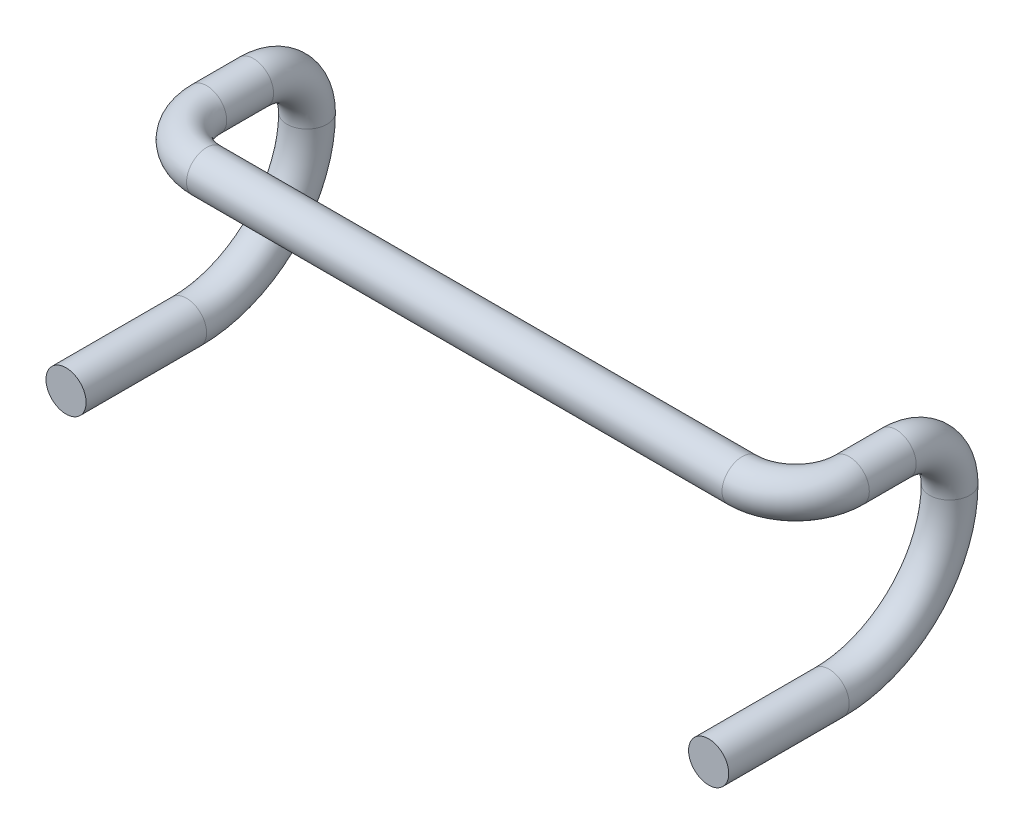
ISO-10303-21;
HEADER;
FILE_DESCRIPTION(('STEP AP214'),'2;1');
FILE_NAME('part.step','',(''),(''),'','','');
FILE_SCHEMA(('AUTOMOTIVE_DESIGN { 1 0 10303 214 1 1 1 1 }'));
ENDSEC;
DATA;
#1=APPLICATION_CONTEXT('core data for automotive mechanical design processes');
#2=APPLICATION_PROTOCOL_DEFINITION('international standard','automotive_design',2000,#1);
#3=PRODUCT_CONTEXT('',#1,'mechanical');
#4=PRODUCT('Part','Part','',(#3));
#5=PRODUCT_RELATED_PRODUCT_CATEGORY('part','',(#4));
#6=PRODUCT_DEFINITION_FORMATION('','',#4);
#7=PRODUCT_DEFINITION_CONTEXT('part definition',#1,'design');
#8=PRODUCT_DEFINITION('design','',#6,#7);
#9=PRODUCT_DEFINITION_SHAPE('','',#8);
#10=(LENGTH_UNIT() NAMED_UNIT(*) SI_UNIT(.MILLI.,.METRE.));
#11=(NAMED_UNIT(*) PLANE_ANGLE_UNIT() SI_UNIT($,.RADIAN.));
#12=(NAMED_UNIT(*) SI_UNIT($,.STERADIAN.) SOLID_ANGLE_UNIT());
#13=UNCERTAINTY_MEASURE_WITH_UNIT(LENGTH_MEASURE(1.E-05),#10,'distance_accuracy_value','');
#14=(GEOMETRIC_REPRESENTATION_CONTEXT(3) GLOBAL_UNCERTAINTY_ASSIGNED_CONTEXT((#13)) GLOBAL_UNIT_ASSIGNED_CONTEXT((#10,
#11,#12)) REPRESENTATION_CONTEXT('',''));
#15=CARTESIAN_POINT('',(0.,0.,0.));
#16=DIRECTION('',(0.,0.,1.));
#17=DIRECTION('',(1.,0.,0.));
#18=AXIS2_PLACEMENT_3D('',#15,#16,#17);
#19=CARTESIAN_POINT('',(0.,0.,0.));
#20=DIRECTION('',(-1.,0.,0.));
#21=DIRECTION('',(0.,0.,1.));
#22=AXIS2_PLACEMENT_3D('',#19,#20,#21);
#23=CYLINDRICAL_SURFACE('',#22,15.);
#24=CARTESIAN_POINT('',(-200.,0.,0.));
#25=DIRECTION('',(1.,0.,0.));
#26=DIRECTION('',(0.,0.,-1.));
#27=AXIS2_PLACEMENT_3D('',#24,#25,#26);
#28=CIRCLE('',#27,15.);
#29=CARTESIAN_POINT('',(-200.,0.,15.));
#30=VERTEX_POINT('',#29);
#31=EDGE_CURVE('E11',#30,#30,#28,.T.);
#32=ORIENTED_EDGE('',*,*,#31,.T.);
#33=EDGE_LOOP('',(#32));
#34=FACE_BOUND('',#33,.T.);
#35=CARTESIAN_POINT('',(200.,0.,0.));
#36=DIRECTION('',(1.,0.,0.));
#37=DIRECTION('',(0.,0.,-1.));
#38=AXIS2_PLACEMENT_3D('',#35,#36,#37);
#39=CIRCLE('',#38,15.);
#40=CARTESIAN_POINT('',(200.,0.,15.));
#41=VERTEX_POINT('',#40);
#42=EDGE_CURVE('E118',#41,#41,#39,.F.);
#43=ORIENTED_EDGE('',*,*,#42,.T.);
#44=EDGE_LOOP('',(#43));
#45=FACE_BOUND('',#44,.T.);
#46=ADVANCED_FACE('F92',(#34,#45),#23,.T.);
#47=CARTESIAN_POINT('',(-200.,0.,-40.));
#48=DIRECTION('',(0.,-1.,0.));
#49=DIRECTION('',(0.,0.,-1.));
#50=AXIS2_PLACEMENT_3D('',#47,#48,#49);
#51=TOROIDAL_SURFACE('',#50,40.,15.);
#52=CARTESIAN_POINT('',(-240.,0.,-40.));
#53=DIRECTION('',(0.,0.,1.));
#54=DIRECTION('',(-1.,0.,0.));
#55=AXIS2_PLACEMENT_3D('',#52,#53,#54);
#56=CIRCLE('',#55,15.);
#57=CARTESIAN_POINT('',(-255.,0.,-40.));
#58=VERTEX_POINT('',#57);
#59=EDGE_CURVE('E107',#58,#58,#56,.T.);
#60=CARTESIAN_POINT('',(-200.,0.,-40.));
#61=DIRECTION('',(0.,-1.,0.));
#62=DIRECTION('',(0.,0.,-1.));
#63=AXIS2_PLACEMENT_3D('',#60,#61,#62);
#64=CIRCLE('',#63,55.);
#65=EDGE_CURVE('',#30,#58,#64,.T.);
#66=ORIENTED_EDGE('',*,*,#31,.F.);
#67=ORIENTED_EDGE('',*,*,#59,.T.);
#68=ORIENTED_EDGE('',*,*,#65,.T.);
#69=ORIENTED_EDGE('',*,*,#65,.F.);
#70=EDGE_LOOP('',(#66,#68,#67,#69));
#71=FACE_BOUND('',#70,.T.);
#72=ADVANCED_FACE('F94',(#71),#51,.T.);
#73=CARTESIAN_POINT('',(-240.,0.,-40.));
#74=DIRECTION('',(0.,0.,-1.));
#75=DIRECTION('',(-1.,0.,0.));
#76=AXIS2_PLACEMENT_3D('',#73,#74,#75);
#77=CYLINDRICAL_SURFACE('',#76,15.);
#78=CARTESIAN_POINT('',(-240.,0.,-75.));
#79=DIRECTION('',(0.,0.,1.));
#80=DIRECTION('',(-1.,0.,0.));
#81=AXIS2_PLACEMENT_3D('',#78,#79,#80);
#82=CIRCLE('',#81,15.);
#83=CARTESIAN_POINT('',(-240.,15.,-75.));
#84=VERTEX_POINT('',#83);
#85=EDGE_CURVE('E103',#84,#84,#82,.T.);
#86=ORIENTED_EDGE('',*,*,#85,.T.);
#87=EDGE_LOOP('',(#86));
#88=FACE_BOUND('',#87,.T.);
#89=ORIENTED_EDGE('',*,*,#59,.F.);
#90=EDGE_LOOP('',(#89));
#91=FACE_BOUND('',#90,.T.);
#92=ADVANCED_FACE('F171',(#88,#91),#77,.T.);
#93=CARTESIAN_POINT('',(-240.,-40.,-75.));
#94=DIRECTION('',(-1.,0.,0.));
#95=DIRECTION('',(0.,0.,1.));
#96=AXIS2_PLACEMENT_3D('',#93,#94,#95);
#97=TOROIDAL_SURFACE('',#96,40.,15.);
#98=CARTESIAN_POINT('',(-240.,-40.,-115.));
#99=DIRECTION('',(0.,1.,0.));
#100=DIRECTION('',(-1.,0.,0.));
#101=AXIS2_PLACEMENT_3D('',#98,#99,#100);
#102=CIRCLE('',#101,15.);
#103=CARTESIAN_POINT('',(-240.,-40.,-130.));
#104=VERTEX_POINT('',#103);
#105=EDGE_CURVE('E99',#104,#104,#102,.T.);
#106=CARTESIAN_POINT('',(-240.,-40.,-75.));
#107=DIRECTION('',(-1.,0.,0.));
#108=DIRECTION('',(0.,0.,1.));
#109=AXIS2_PLACEMENT_3D('',#106,#107,#108);
#110=CIRCLE('',#109,55.);
#111=EDGE_CURVE('',#84,#104,#110,.T.);
#112=ORIENTED_EDGE('',*,*,#85,.F.);
#113=ORIENTED_EDGE('',*,*,#105,.T.);
#114=ORIENTED_EDGE('',*,*,#111,.T.);
#115=ORIENTED_EDGE('',*,*,#111,.F.);
#116=EDGE_LOOP('',(#112,#114,#113,#115));
#117=FACE_BOUND('',#116,.T.);
#118=ADVANCED_FACE('F175',(#117),#97,.T.);
#119=CARTESIAN_POINT('',(-240.,-40.,-25.));
#120=DIRECTION('',(-1.,0.,0.));
#121=DIRECTION('',(0.,0.,1.));
#122=AXIS2_PLACEMENT_3D('',#119,#120,#121);
#123=TOROIDAL_SURFACE('',#122,90.,15.);
#124=CARTESIAN_POINT('',(-240.,-130.,-25.));
#125=DIRECTION('',(0.,0.,1.));
#126=DIRECTION('',(1.,0.,0.));
#127=AXIS2_PLACEMENT_3D('',#124,#125,#126);
#128=CIRCLE('',#127,15.);
#129=CARTESIAN_POINT('',(-240.,-145.,-25.));
#130=VERTEX_POINT('',#129);
#131=EDGE_CURVE('E115',#130,#130,#128,.T.);
#132=CARTESIAN_POINT('',(-240.,-40.,-25.));
#133=DIRECTION('',(-1.,0.,0.));
#134=DIRECTION('',(0.,0.,1.));
#135=AXIS2_PLACEMENT_3D('',#132,#133,#134);
#136=CIRCLE('',#135,105.);
#137=EDGE_CURVE('',#104,#130,#136,.T.);
#138=ORIENTED_EDGE('',*,*,#105,.F.);
#139=ORIENTED_EDGE('',*,*,#131,.F.);
#140=ORIENTED_EDGE('',*,*,#137,.T.);
#141=ORIENTED_EDGE('',*,*,#137,.F.);
#142=EDGE_LOOP('',(#138,#140,#139,#141));
#143=FACE_BOUND('',#142,.T.);
#144=ADVANCED_FACE('F167',(#143),#123,.T.);
#145=CARTESIAN_POINT('',(-240.,-130.,65.));
#146=DIRECTION('',(0.,0.,1.));
#147=DIRECTION('',(1.,0.,0.));
#148=AXIS2_PLACEMENT_3D('',#145,#146,#147);
#149=PLANE('',#148);
#150=CARTESIAN_POINT('',(-240.,-130.,65.));
#151=DIRECTION('',(0.,0.,1.));
#152=DIRECTION('',(1.,0.,0.));
#153=AXIS2_PLACEMENT_3D('',#150,#151,#152);
#154=CIRCLE('',#153,15.);
#155=CARTESIAN_POINT('',(-225.,-130.,65.));
#156=VERTEX_POINT('',#155);
#157=EDGE_CURVE('E112',#156,#156,#154,.T.);
#158=ORIENTED_EDGE('',*,*,#157,.T.);
#159=EDGE_LOOP('',(#158));
#160=FACE_BOUND('',#159,.T.);
#161=ADVANCED_FACE('F163',(#160),#149,.T.);
#162=CARTESIAN_POINT('',(-240.,-130.,-25.));
#163=DIRECTION('',(0.,0.,1.));
#164=DIRECTION('',(1.,0.,0.));
#165=AXIS2_PLACEMENT_3D('',#162,#163,#164);
#166=CYLINDRICAL_SURFACE('',#165,15.);
#167=ORIENTED_EDGE('',*,*,#157,.F.);
#168=EDGE_LOOP('',(#167));
#169=FACE_BOUND('',#168,.T.);
#170=ORIENTED_EDGE('',*,*,#131,.T.);
#171=EDGE_LOOP('',(#170));
#172=FACE_BOUND('',#171,.T.);
#173=ADVANCED_FACE('F161',(#169,#172),#166,.T.);
#174=CARTESIAN_POINT('',(200.,0.,-40.));
#175=DIRECTION('',(0.,1.,0.));
#176=DIRECTION('',(0.,0.,1.));
#177=AXIS2_PLACEMENT_3D('',#174,#175,#176);
#178=TOROIDAL_SURFACE('',#177,40.,15.);
#179=CARTESIAN_POINT('',(240.,0.,-40.));
#180=DIRECTION('',(0.,0.,-1.));
#181=DIRECTION('',(1.,0.,0.));
#182=AXIS2_PLACEMENT_3D('',#179,#180,#181);
#183=CIRCLE('',#182,15.);
#184=CARTESIAN_POINT('',(255.,0.,-40.));
#185=VERTEX_POINT('',#184);
#186=EDGE_CURVE('E127',#185,#185,#183,.F.);
#187=CARTESIAN_POINT('',(200.,0.,-40.));
#188=DIRECTION('',(0.,1.,0.));
#189=DIRECTION('',(0.,0.,1.));
#190=AXIS2_PLACEMENT_3D('',#187,#188,#189);
#191=CIRCLE('',#190,55.);
#192=EDGE_CURVE('',#41,#185,#191,.T.);
#193=ORIENTED_EDGE('',*,*,#42,.F.);
#194=ORIENTED_EDGE('',*,*,#186,.T.);
#195=ORIENTED_EDGE('',*,*,#192,.T.);
#196=ORIENTED_EDGE('',*,*,#192,.F.);
#197=EDGE_LOOP('',(#193,#195,#194,#196));
#198=FACE_BOUND('',#197,.T.);
#199=ADVANCED_FACE('F145',(#198),#178,.T.);
#200=CARTESIAN_POINT('',(240.,0.,-40.));
#201=DIRECTION('',(0.,0.,-1.));
#202=DIRECTION('',(-1.,0.,0.));
#203=AXIS2_PLACEMENT_3D('',#200,#201,#202);
#204=CYLINDRICAL_SURFACE('',#203,15.);
#205=CARTESIAN_POINT('',(240.,0.,-75.));
#206=DIRECTION('',(0.,0.,-1.));
#207=DIRECTION('',(1.,0.,0.));
#208=AXIS2_PLACEMENT_3D('',#205,#206,#207);
#209=CIRCLE('',#208,15.);
#210=CARTESIAN_POINT('',(240.,15.,-75.));
#211=VERTEX_POINT('',#210);
#212=EDGE_CURVE('E124',#211,#211,#209,.F.);
#213=ORIENTED_EDGE('',*,*,#212,.T.);
#214=EDGE_LOOP('',(#213));
#215=FACE_BOUND('',#214,.T.);
#216=ORIENTED_EDGE('',*,*,#186,.F.);
#217=EDGE_LOOP('',(#216));
#218=FACE_BOUND('',#217,.T.);
#219=ADVANCED_FACE('F150',(#215,#218),#204,.T.);
#220=CARTESIAN_POINT('',(240.,-40.,-75.));
#221=DIRECTION('',(-1.,0.,0.));
#222=DIRECTION('',(0.,0.,1.));
#223=AXIS2_PLACEMENT_3D('',#220,#221,#222);
#224=TOROIDAL_SURFACE('',#223,40.,15.);
#225=CARTESIAN_POINT('',(240.,-40.,-115.));
#226=DIRECTION('',(0.,-1.,0.));
#227=DIRECTION('',(1.,0.,0.));
#228=AXIS2_PLACEMENT_3D('',#225,#226,#227);
#229=CIRCLE('',#228,15.);
#230=CARTESIAN_POINT('',(240.,-40.,-130.));
#231=VERTEX_POINT('',#230);
#232=EDGE_CURVE('E121',#231,#231,#229,.F.);
#233=CARTESIAN_POINT('',(240.,-40.,-75.));
#234=DIRECTION('',(-1.,0.,0.));
#235=DIRECTION('',(0.,0.,1.));
#236=AXIS2_PLACEMENT_3D('',#233,#234,#235);
#237=CIRCLE('',#236,55.);
#238=EDGE_CURVE('',#211,#231,#237,.T.);
#239=ORIENTED_EDGE('',*,*,#212,.F.);
#240=ORIENTED_EDGE('',*,*,#232,.T.);
#241=ORIENTED_EDGE('',*,*,#238,.T.);
#242=ORIENTED_EDGE('',*,*,#238,.F.);
#243=EDGE_LOOP('',(#239,#241,#240,#242));
#244=FACE_BOUND('',#243,.T.);
#245=ADVANCED_FACE('F143',(#244),#224,.T.);
#246=CARTESIAN_POINT('',(240.,-40.,-25.));
#247=DIRECTION('',(-1.,0.,0.));
#248=DIRECTION('',(0.,0.,1.));
#249=AXIS2_PLACEMENT_3D('',#246,#247,#248);
#250=TOROIDAL_SURFACE('',#249,90.,15.);
#251=CARTESIAN_POINT('',(240.,-130.,-25.));
#252=DIRECTION('',(0.,0.,-1.));
#253=DIRECTION('',(-1.,0.,0.));
#254=AXIS2_PLACEMENT_3D('',#251,#252,#253);
#255=CIRCLE('',#254,15.);
#256=CARTESIAN_POINT('',(240.,-145.,-25.));
#257=VERTEX_POINT('',#256);
#258=EDGE_CURVE('E133',#257,#257,#255,.F.);
#259=CARTESIAN_POINT('',(240.,-40.,-25.));
#260=DIRECTION('',(-1.,0.,0.));
#261=DIRECTION('',(0.,0.,1.));
#262=AXIS2_PLACEMENT_3D('',#259,#260,#261);
#263=CIRCLE('',#262,105.);
#264=EDGE_CURVE('',#231,#257,#263,.T.);
#265=ORIENTED_EDGE('',*,*,#232,.F.);
#266=ORIENTED_EDGE('',*,*,#258,.F.);
#267=ORIENTED_EDGE('',*,*,#264,.T.);
#268=ORIENTED_EDGE('',*,*,#264,.F.);
#269=EDGE_LOOP('',(#265,#267,#266,#268));
#270=FACE_BOUND('',#269,.T.);
#271=ADVANCED_FACE('F139',(#270),#250,.T.);
#272=CARTESIAN_POINT('',(240.,-130.,65.));
#273=DIRECTION('',(0.,0.,1.));
#274=DIRECTION('',(-1.,0.,0.));
#275=AXIS2_PLACEMENT_3D('',#272,#273,#274);
#276=PLANE('',#275);
#277=CARTESIAN_POINT('',(240.,-130.,65.));
#278=DIRECTION('',(0.,0.,-1.));
#279=DIRECTION('',(-1.,0.,0.));
#280=AXIS2_PLACEMENT_3D('',#277,#278,#279);
#281=CIRCLE('',#280,15.);
#282=CARTESIAN_POINT('',(225.,-130.,65.));
#283=VERTEX_POINT('',#282);
#284=EDGE_CURVE('E130',#283,#283,#281,.F.);
#285=ORIENTED_EDGE('',*,*,#284,.T.);
#286=EDGE_LOOP('',(#285));
#287=FACE_BOUND('',#286,.T.);
#288=ADVANCED_FACE('F142',(#287),#276,.T.);
#289=CARTESIAN_POINT('',(240.,-130.,-25.));
#290=DIRECTION('',(0.,0.,1.));
#291=DIRECTION('',(1.,0.,0.));
#292=AXIS2_PLACEMENT_3D('',#289,#290,#291);
#293=CYLINDRICAL_SURFACE('',#292,15.);
#294=ORIENTED_EDGE('',*,*,#284,.F.);
#295=EDGE_LOOP('',(#294));
#296=FACE_BOUND('',#295,.T.);
#297=ORIENTED_EDGE('',*,*,#258,.T.);
#298=EDGE_LOOP('',(#297));
#299=FACE_BOUND('',#298,.T.);
#300=ADVANCED_FACE('F137',(#296,#299),#293,.T.);
#301=CLOSED_SHELL('',(#46,#72,#92,#118,#144,#161,#173,#199,#219,#245,#271,#288,#300));
#302=MANIFOLD_SOLID_BREP('B2',#301);
#303=ADVANCED_BREP_SHAPE_REPRESENTATION('',(#18,#302),#14);
#304=SHAPE_DEFINITION_REPRESENTATION(#9,#303);
ENDSEC;
END-ISO-10303-21;
